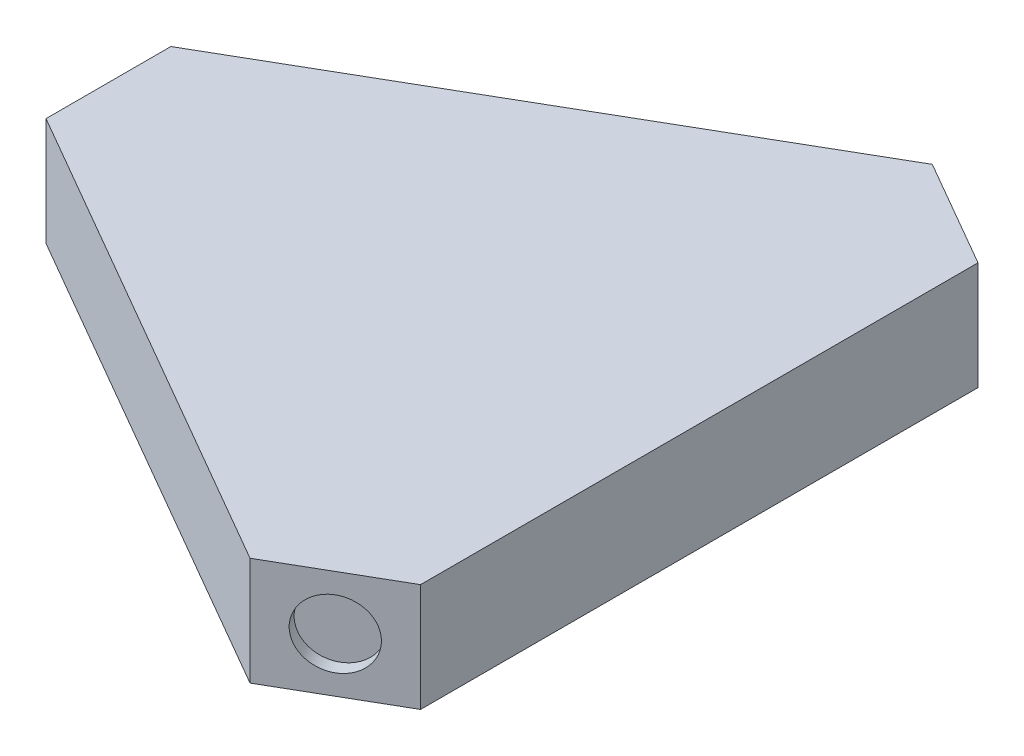
ISO-10303-21;
HEADER;
FILE_DESCRIPTION(('STEP AP214'),'2;1');
FILE_NAME('part.step','',(''),(''),'','','');
FILE_SCHEMA(('AUTOMOTIVE_DESIGN { 1 0 10303 214 1 1 1 1 }'));
ENDSEC;
DATA;
#1=APPLICATION_CONTEXT('core data for automotive mechanical design processes');
#2=APPLICATION_PROTOCOL_DEFINITION('international standard','automotive_design',2000,#1);
#3=PRODUCT_CONTEXT('',#1,'mechanical');
#4=PRODUCT('Part','Part','',(#3));
#5=PRODUCT_RELATED_PRODUCT_CATEGORY('part','',(#4));
#6=PRODUCT_DEFINITION_FORMATION('','',#4);
#7=PRODUCT_DEFINITION_CONTEXT('part definition',#1,'design');
#8=PRODUCT_DEFINITION('design','',#6,#7);
#9=PRODUCT_DEFINITION_SHAPE('','',#8);
#10=(LENGTH_UNIT() NAMED_UNIT(*) SI_UNIT(.MILLI.,.METRE.));
#11=(NAMED_UNIT(*) PLANE_ANGLE_UNIT() SI_UNIT($,.RADIAN.));
#12=(NAMED_UNIT(*) SI_UNIT($,.STERADIAN.) SOLID_ANGLE_UNIT());
#13=UNCERTAINTY_MEASURE_WITH_UNIT(LENGTH_MEASURE(1.E-05),#10,'distance_accuracy_value','');
#14=(GEOMETRIC_REPRESENTATION_CONTEXT(3) GLOBAL_UNCERTAINTY_ASSIGNED_CONTEXT((#13)) GLOBAL_UNIT_ASSIGNED_CONTEXT((#10,
#11,#12)) REPRESENTATION_CONTEXT('',''));
#15=CARTESIAN_POINT('',(0.,0.,0.));
#16=DIRECTION('',(0.,0.,1.));
#17=DIRECTION('',(1.,0.,0.));
#18=AXIS2_PLACEMENT_3D('',#15,#16,#17);
#19=CARTESIAN_POINT('',(22.3463500000001,8.,-47.9426178707508));
#20=DIRECTION('',(-0.5,0.,0.866025403784439));
#21=DIRECTION('',(0.866025403784439,0.,0.5));
#22=AXIS2_PLACEMENT_3D('',#19,#20,#21);
#23=PLANE('',#22);
#24=CARTESIAN_POINT('',(26.34635,4.,-45.6332167939923));
#25=DIRECTION('',(0.5,0.,-0.866025403784439));
#26=DIRECTION('',(-0.866025403784439,0.,-0.5));
#27=AXIS2_PLACEMENT_3D('',#24,#25,#26);
#28=CIRCLE('',#27,2.5);
#29=CARTESIAN_POINT('',(24.1812864905389,4.,-46.8832167939923));
#30=VERTEX_POINT('',#29);
#31=EDGE_CURVE('E172',#30,#30,#28,.T.);
#32=ORIENTED_EDGE('',*,*,#31,.F.);
#33=EDGE_LOOP('',(#32));
#34=FACE_BOUND('',#33,.T.);
#35=DIRECTION('',(-0.866025403784439,0.,-0.5));
#36=VECTOR('',#35,1.);
#37=CARTESIAN_POINT('',(22.3463500000001,0.,-47.9426178707508));
#38=LINE('',#37,#36);
#39=CARTESIAN_POINT('',(30.34635,0.,-43.3238157172339));
#40=VERTEX_POINT('',#39);
#41=CARTESIAN_POINT('',(22.3463500000001,0.,-47.9426178707508));
#42=VERTEX_POINT('',#41);
#43=EDGE_CURVE('E129',#40,#42,#38,.T.);
#44=ORIENTED_EDGE('',*,*,#43,.T.);
#45=DIRECTION('',(0.,-1.,0.));
#46=VECTOR('',#45,1.);
#47=CARTESIAN_POINT('',(22.3463500000001,8.,-47.9426178707508));
#48=LINE('',#47,#46);
#49=CARTESIAN_POINT('',(22.3463500000001,8.,-47.9426178707508));
#50=VERTEX_POINT('',#49);
#51=EDGE_CURVE('E11',#50,#42,#48,.T.);
#52=ORIENTED_EDGE('',*,*,#51,.F.);
#53=DIRECTION('',(-0.866025403784439,0.,-0.5));
#54=VECTOR('',#53,1.);
#55=CARTESIAN_POINT('',(22.3463500000001,8.,-47.9426178707508));
#56=LINE('',#55,#54);
#57=CARTESIAN_POINT('',(30.34635,8.,-43.3238157172339));
#58=VERTEX_POINT('',#57);
#59=EDGE_CURVE('E140',#58,#50,#56,.T.);
#60=ORIENTED_EDGE('',*,*,#59,.F.);
#61=DIRECTION('',(0.,-1.,0.));
#62=VECTOR('',#61,1.);
#63=CARTESIAN_POINT('',(30.34635,8.,-43.3238157172339));
#64=LINE('',#63,#62);
#65=EDGE_CURVE('E125',#58,#40,#64,.T.);
#66=ORIENTED_EDGE('',*,*,#65,.T.);
#67=EDGE_LOOP('',(#44,#52,#60,#66));
#68=FACE_BOUND('',#67,.T.);
#69=ADVANCED_FACE('F45',(#34,#68),#23,.F.);
#70=CARTESIAN_POINT('',(22.3463500000001,8.,-47.9426178707508));
#71=DIRECTION('',(0.5,0.,0.866025403784439));
#72=DIRECTION('',(0.866025403784439,0.,-0.5));
#73=AXIS2_PLACEMENT_3D('',#70,#71,#72);
#74=PLANE('',#73);
#75=DIRECTION('',(-0.866025403784439,0.,0.5));
#76=VECTOR('',#75,1.);
#77=CARTESIAN_POINT('',(22.3463500000001,0.,-47.9426178707508));
#78=LINE('',#77,#76);
#79=CARTESIAN_POINT('',(-13.3696000000001,0.,-27.3220045238875));
#80=VERTEX_POINT('',#79);
#81=EDGE_CURVE('E132',#42,#80,#78,.T.);
#82=ORIENTED_EDGE('',*,*,#81,.T.);
#83=DIRECTION('',(0.,-1.,0.));
#84=VECTOR('',#83,1.);
#85=CARTESIAN_POINT('',(-13.3696000000001,8.,-27.3220045238875));
#86=LINE('',#85,#84);
#87=CARTESIAN_POINT('',(-13.3696000000001,8.,-27.3220045238875));
#88=VERTEX_POINT('',#87);
#89=EDGE_CURVE('E53',#88,#80,#86,.T.);
#90=ORIENTED_EDGE('',*,*,#89,.F.);
#91=DIRECTION('',(-0.866025403784439,0.,0.5));
#92=VECTOR('',#91,1.);
#93=CARTESIAN_POINT('',(22.3463500000001,8.,-47.9426178707508));
#94=LINE('',#93,#92);
#95=EDGE_CURVE('E98',#50,#88,#94,.T.);
#96=ORIENTED_EDGE('',*,*,#95,.F.);
#97=ORIENTED_EDGE('',*,*,#51,.T.);
#98=EDGE_LOOP('',(#82,#90,#96,#97));
#99=FACE_BOUND('',#98,.T.);
#100=ADVANCED_FACE('F165',(#99),#74,.F.);
#101=CARTESIAN_POINT('',(-13.3696000000001,8.,-27.3220045238875));
#102=DIRECTION('',(1.,0.,0.));
#103=DIRECTION('',(0.,0.,-1.));
#104=AXIS2_PLACEMENT_3D('',#101,#102,#103);
#105=PLANE('',#104);
#106=CARTESIAN_POINT('',(-13.3695999999999,4.,-22.7032023703705));
#107=DIRECTION('',(-1.,0.,0.));
#108=DIRECTION('',(0.,0.,1.));
#109=AXIS2_PLACEMENT_3D('',#106,#107,#108);
#110=CIRCLE('',#109,2.5);
#111=CARTESIAN_POINT('',(-13.3695999999999,4.,-20.2032023703705));
#112=VERTEX_POINT('',#111);
#113=EDGE_CURVE('E179',#112,#112,#110,.T.);
#114=ORIENTED_EDGE('',*,*,#113,.F.);
#115=EDGE_LOOP('',(#114));
#116=FACE_BOUND('',#115,.T.);
#117=DIRECTION('',(0.,0.,1.));
#118=VECTOR('',#117,1.);
#119=CARTESIAN_POINT('',(-13.3696000000001,0.,-27.3220045238875));
#120=LINE('',#119,#118);
#121=CARTESIAN_POINT('',(-13.3696000000001,0.,-18.0844002168536));
#122=VERTEX_POINT('',#121);
#123=EDGE_CURVE('E135',#80,#122,#120,.T.);
#124=ORIENTED_EDGE('',*,*,#123,.T.);
#125=DIRECTION('',(0.,-1.,0.));
#126=VECTOR('',#125,1.);
#127=CARTESIAN_POINT('',(-13.3696000000001,8.,-18.0844002168536));
#128=LINE('',#127,#126);
#129=CARTESIAN_POINT('',(-13.3696000000001,8.,-18.0844002168536));
#130=VERTEX_POINT('',#129);
#131=EDGE_CURVE('E120',#130,#122,#128,.T.);
#132=ORIENTED_EDGE('',*,*,#131,.F.);
#133=DIRECTION('',(0.,0.,1.));
#134=VECTOR('',#133,1.);
#135=CARTESIAN_POINT('',(-13.3696000000001,8.,-27.3220045238875));
#136=LINE('',#135,#134);
#137=EDGE_CURVE('E111',#88,#130,#136,.T.);
#138=ORIENTED_EDGE('',*,*,#137,.F.);
#139=ORIENTED_EDGE('',*,*,#89,.T.);
#140=EDGE_LOOP('',(#124,#132,#138,#139));
#141=FACE_BOUND('',#140,.T.);
#142=ADVANCED_FACE('F146',(#116,#141),#105,.F.);
#143=CARTESIAN_POINT('',(-13.3696000000001,8.,-18.0844002168536));
#144=DIRECTION('',(0.5,0.,-0.866025403784439));
#145=DIRECTION('',(-0.866025403784439,0.,-0.5));
#146=AXIS2_PLACEMENT_3D('',#143,#144,#145);
#147=PLANE('',#146);
#148=DIRECTION('',(0.866025403784439,0.,0.5));
#149=VECTOR('',#148,1.);
#150=CARTESIAN_POINT('',(-13.3696000000001,0.,-18.0844002168536));
#151=LINE('',#150,#149);
#152=CARTESIAN_POINT('',(22.3463500000001,0.,2.53621313000971));
#153=VERTEX_POINT('',#152);
#154=EDGE_CURVE('E119',#122,#153,#151,.T.);
#155=ORIENTED_EDGE('',*,*,#154,.T.);
#156=DIRECTION('',(0.,-1.,0.));
#157=VECTOR('',#156,1.);
#158=CARTESIAN_POINT('',(22.3463500000001,8.,2.53621313000971));
#159=LINE('',#158,#157);
#160=CARTESIAN_POINT('',(22.3463500000001,8.,2.53621313000971));
#161=VERTEX_POINT('',#160);
#162=EDGE_CURVE('E116',#161,#153,#159,.T.);
#163=ORIENTED_EDGE('',*,*,#162,.F.);
#164=DIRECTION('',(0.866025403784439,0.,0.5));
#165=VECTOR('',#164,1.);
#166=CARTESIAN_POINT('',(-13.3696000000001,8.,-18.0844002168536));
#167=LINE('',#166,#165);
#168=EDGE_CURVE('E105',#130,#161,#167,.T.);
#169=ORIENTED_EDGE('',*,*,#168,.F.);
#170=ORIENTED_EDGE('',*,*,#131,.T.);
#171=EDGE_LOOP('',(#155,#163,#169,#170));
#172=FACE_BOUND('',#171,.T.);
#173=ADVANCED_FACE('F117',(#172),#147,.F.);
#174=CARTESIAN_POINT('',(30.34635,8.,-2.08258902350725));
#175=DIRECTION('',(-0.5,0.,-0.866025403784439));
#176=DIRECTION('',(-0.866025403784439,0.,0.5));
#177=AXIS2_PLACEMENT_3D('',#174,#175,#176);
#178=PLANE('',#177);
#179=CARTESIAN_POINT('',(26.3463500000003,4.,0.226812053250883));
#180=DIRECTION('',(0.500000000000008,0.,0.866025403784434));
#181=DIRECTION('',(0.866025403784434,0.,-0.500000000000008));
#182=AXIS2_PLACEMENT_3D('',#179,#180,#181);
#183=CIRCLE('',#182,2.5);
#184=CARTESIAN_POINT('',(28.5114135094613,4.,-1.02318794674914));
#185=VERTEX_POINT('',#184);
#186=EDGE_CURVE('E184',#185,#185,#183,.T.);
#187=ORIENTED_EDGE('',*,*,#186,.F.);
#188=EDGE_LOOP('',(#187));
#189=FACE_BOUND('',#188,.T.);
#190=DIRECTION('',(0.866025403784439,0.,-0.5));
#191=VECTOR('',#190,1.);
#192=CARTESIAN_POINT('',(30.34635,0.,-2.08258902350725));
#193=LINE('',#192,#191);
#194=CARTESIAN_POINT('',(30.34635,0.,-2.08258902350725));
#195=VERTEX_POINT('',#194);
#196=EDGE_CURVE('E84',#153,#195,#193,.T.);
#197=ORIENTED_EDGE('',*,*,#196,.T.);
#198=DIRECTION('',(0.,-1.,0.));
#199=VECTOR('',#198,1.);
#200=CARTESIAN_POINT('',(30.34635,8.,-2.08258902350725));
#201=LINE('',#200,#199);
#202=CARTESIAN_POINT('',(30.34635,8.,-2.08258902350725));
#203=VERTEX_POINT('',#202);
#204=EDGE_CURVE('E121',#203,#195,#201,.T.);
#205=ORIENTED_EDGE('',*,*,#204,.F.);
#206=DIRECTION('',(0.866025403784439,0.,-0.5));
#207=VECTOR('',#206,1.);
#208=CARTESIAN_POINT('',(30.34635,8.,-2.08258902350725));
#209=LINE('',#208,#207);
#210=EDGE_CURVE('E109',#161,#203,#209,.T.);
#211=ORIENTED_EDGE('',*,*,#210,.F.);
#212=ORIENTED_EDGE('',*,*,#162,.T.);
#213=EDGE_LOOP('',(#197,#205,#211,#212));
#214=FACE_BOUND('',#213,.T.);
#215=ADVANCED_FACE('F123',(#189,#214),#178,.F.);
#216=CARTESIAN_POINT('',(30.34635,8.,-2.08258902350725));
#217=DIRECTION('',(-1.,0.,0.));
#218=DIRECTION('',(0.,0.,1.));
#219=AXIS2_PLACEMENT_3D('',#216,#217,#218);
#220=PLANE('',#219);
#221=DIRECTION('',(0.,0.,-1.));
#222=VECTOR('',#221,1.);
#223=CARTESIAN_POINT('',(30.34635,0.,-2.08258902350725));
#224=LINE('',#223,#222);
#225=EDGE_CURVE('E90',#195,#40,#224,.T.);
#226=ORIENTED_EDGE('',*,*,#225,.T.);
#227=ORIENTED_EDGE('',*,*,#65,.F.);
#228=DIRECTION('',(0.,0.,-1.));
#229=VECTOR('',#228,1.);
#230=CARTESIAN_POINT('',(30.34635,8.,-2.08258902350725));
#231=LINE('',#230,#229);
#232=EDGE_CURVE('E61',#203,#58,#231,.T.);
#233=ORIENTED_EDGE('',*,*,#232,.F.);
#234=ORIENTED_EDGE('',*,*,#204,.T.);
#235=EDGE_LOOP('',(#226,#227,#233,#234));
#236=FACE_BOUND('',#235,.T.);
#237=ADVANCED_FACE('F153',(#236),#220,.F.);
#238=CARTESIAN_POINT('',(0.,8.,0.));
#239=DIRECTION('',(0.,1.,0.));
#240=DIRECTION('',(0.,0.,1.));
#241=AXIS2_PLACEMENT_3D('',#238,#239,#240);
#242=PLANE('',#241);
#243=ORIENTED_EDGE('',*,*,#59,.T.);
#244=ORIENTED_EDGE('',*,*,#95,.T.);
#245=ORIENTED_EDGE('',*,*,#137,.T.);
#246=ORIENTED_EDGE('',*,*,#168,.T.);
#247=ORIENTED_EDGE('',*,*,#210,.T.);
#248=ORIENTED_EDGE('',*,*,#232,.T.);
#249=EDGE_LOOP('',(#243,#244,#245,#246,#247,#248));
#250=FACE_BOUND('',#249,.T.);
#251=ADVANCED_FACE('F107',(#250),#242,.T.);
#252=CARTESIAN_POINT('',(0.,0.,0.));
#253=DIRECTION('',(0.,1.,0.));
#254=DIRECTION('',(0.,0.,1.));
#255=AXIS2_PLACEMENT_3D('',#252,#253,#254);
#256=PLANE('',#255);
#257=ORIENTED_EDGE('',*,*,#43,.F.);
#258=ORIENTED_EDGE('',*,*,#225,.F.);
#259=ORIENTED_EDGE('',*,*,#196,.F.);
#260=ORIENTED_EDGE('',*,*,#154,.F.);
#261=ORIENTED_EDGE('',*,*,#123,.F.);
#262=ORIENTED_EDGE('',*,*,#81,.F.);
#263=EDGE_LOOP('',(#257,#258,#259,#260,#261,#262));
#264=FACE_BOUND('',#263,.T.);
#265=ADVANCED_FACE('F149',(#264),#256,.F.);
#266=CARTESIAN_POINT('',(25.84635,4.,-44.7671913902079));
#267=DIRECTION('',(0.5,0.,-0.866025403784439));
#268=DIRECTION('',(-0.866025403784439,0.,-0.5));
#269=AXIS2_PLACEMENT_3D('',#266,#267,#268);
#270=CYLINDRICAL_SURFACE('',#269,2.5);
#271=CARTESIAN_POINT('',(25.84635,4.,-44.7671913902079));
#272=DIRECTION('',(0.5,0.,-0.866025403784439));
#273=DIRECTION('',(-0.866025403784439,0.,-0.5));
#274=AXIS2_PLACEMENT_3D('',#271,#272,#273);
#275=CIRCLE('',#274,2.5);
#276=CARTESIAN_POINT('',(23.6812864905389,4.,-46.0171913902079));
#277=VERTEX_POINT('',#276);
#278=EDGE_CURVE('E133',#277,#277,#275,.T.);
#279=ORIENTED_EDGE('',*,*,#278,.F.);
#280=EDGE_LOOP('',(#279));
#281=FACE_BOUND('',#280,.T.);
#282=ORIENTED_EDGE('',*,*,#31,.T.);
#283=EDGE_LOOP('',(#282));
#284=FACE_BOUND('',#283,.T.);
#285=ADVANCED_FACE('F223',(#281,#284),#270,.F.);
#286=CARTESIAN_POINT('',(25.84635,4.,-44.7671913902079));
#287=DIRECTION('',(0.5,0.,-0.866025403784439));
#288=DIRECTION('',(-0.866025403784439,0.,-0.5));
#289=AXIS2_PLACEMENT_3D('',#286,#287,#288);
#290=PLANE('',#289);
#291=ORIENTED_EDGE('',*,*,#278,.T.);
#292=EDGE_LOOP('',(#291));
#293=FACE_BOUND('',#292,.T.);
#294=ADVANCED_FACE('F236',(#293),#290,.T.);
#295=CARTESIAN_POINT('',(25.8463500000002,4.,-0.639213350533551));
#296=DIRECTION('',(0.500000000000008,0.,0.866025403784434));
#297=DIRECTION('',(0.866025403784434,0.,-0.500000000000008));
#298=AXIS2_PLACEMENT_3D('',#295,#296,#297);
#299=CYLINDRICAL_SURFACE('',#298,2.5);
#300=CARTESIAN_POINT('',(25.8463500000002,4.,-0.639213350533551));
#301=DIRECTION('',(0.500000000000008,0.,0.866025403784434));
#302=DIRECTION('',(0.866025403784434,0.,-0.500000000000008));
#303=AXIS2_PLACEMENT_3D('',#300,#301,#302);
#304=CIRCLE('',#303,2.5);
#305=CARTESIAN_POINT('',(28.0114135094613,4.,-1.88921335053357));
#306=VERTEX_POINT('',#305);
#307=EDGE_CURVE('E187',#306,#306,#304,.T.);
#308=CARTESIAN_POINT('',(28.0114135094613,4.,-1.88921335053357));
#309=CARTESIAN_POINT('',(28.0166218427947,4.,-1.88019225257748));
#310=CARTESIAN_POINT('',(28.021830176128,4.,-1.8711711546214));
#311=CARTESIAN_POINT('',(28.0322468427947,4.,-1.85312895870922));
#312=CARTESIAN_POINT('',(28.037455176128,4.,-1.84410786075313));
#313=CARTESIAN_POINT('',(28.0478718427947,4.,-1.82606566484096));
#314=CARTESIAN_POINT('',(28.053080176128,4.,-1.81704456688487));
#315=CARTESIAN_POINT('',(28.0634968427947,4.,-1.79900237097269));
#316=CARTESIAN_POINT('',(28.068705176128,4.,-1.78998127301661));
#317=CARTESIAN_POINT('',(28.0791218427947,4.,-1.77193907710443));
#318=CARTESIAN_POINT('',(28.084330176128,4.,-1.76291797914834));
#319=CARTESIAN_POINT('',(28.0947468427947,4.,-1.74487578323617));
#320=CARTESIAN_POINT('',(28.099955176128,4.,-1.73585468528008));
#321=CARTESIAN_POINT('',(28.1103718427947,4.,-1.7178124893679));
#322=CARTESIAN_POINT('',(28.115580176128,4.,-1.70879139141182));
#323=CARTESIAN_POINT('',(28.1259968427947,4.,-1.69074919549964));
#324=CARTESIAN_POINT('',(28.131205176128,4.,-1.68172809754355));
#325=CARTESIAN_POINT('',(28.1416218427947,4.,-1.66368590163138));
#326=CARTESIAN_POINT('',(28.146830176128,4.,-1.65466480367529));
#327=CARTESIAN_POINT('',(28.1572468427947,4.,-1.63662260776311));
#328=CARTESIAN_POINT('',(28.162455176128,4.,-1.62760150980703));
#329=CARTESIAN_POINT('',(28.1728718427947,4.,-1.60955931389485));
#330=CARTESIAN_POINT('',(28.178080176128,4.,-1.60053821593876));
#331=CARTESIAN_POINT('',(28.1884968427947,4.,-1.58249602002659));
#332=CARTESIAN_POINT('',(28.193705176128,4.,-1.5734749220705));
#333=CARTESIAN_POINT('',(28.2041218427947,4.,-1.55543272615832));
#334=CARTESIAN_POINT('',(28.209330176128,4.,-1.54641162820223));
#335=CARTESIAN_POINT('',(28.2197468427947,4.,-1.52836943229006));
#336=CARTESIAN_POINT('',(28.224955176128,4.,-1.51934833433397));
#337=CARTESIAN_POINT('',(28.2353718427947,4.,-1.5013061384218));
#338=CARTESIAN_POINT('',(28.240580176128,4.,-1.49228504046571));
#339=CARTESIAN_POINT('',(28.2509968427947,4.,-1.47424284455353));
#340=CARTESIAN_POINT('',(28.256205176128,4.,-1.46522174659744));
#341=CARTESIAN_POINT('',(28.2666218427947,4.,-1.44717955068527));
#342=CARTESIAN_POINT('',(28.271830176128,4.,-1.43815845272918));
#343=CARTESIAN_POINT('',(28.2822468427947,4.,-1.420116256817));
#344=CARTESIAN_POINT('',(28.287455176128,4.,-1.41109515886092));
#345=CARTESIAN_POINT('',(28.2978718427947,4.,-1.39305296294874));
#346=CARTESIAN_POINT('',(28.303080176128,4.,-1.38403186499265));
#347=CARTESIAN_POINT('',(28.3134968427947,4.,-1.36598966908048));
#348=CARTESIAN_POINT('',(28.318705176128,4.,-1.35696857112439));
#349=CARTESIAN_POINT('',(28.3291218427947,4.,-1.33892637521221));
#350=CARTESIAN_POINT('',(28.334330176128,4.,-1.32990527725613));
#351=CARTESIAN_POINT('',(28.3447468427947,4.,-1.31186308134395));
#352=CARTESIAN_POINT('',(28.349955176128,4.,-1.30284198338786));
#353=CARTESIAN_POINT('',(28.3603718427947,4.,-1.28479978747569));
#354=CARTESIAN_POINT('',(28.365580176128,4.,-1.2757786895196));
#355=CARTESIAN_POINT('',(28.3759968427947,4.,-1.25773649360742));
#356=CARTESIAN_POINT('',(28.381205176128,4.,-1.24871539565134));
#357=CARTESIAN_POINT('',(28.3916218427947,4.,-1.23067319973916));
#358=CARTESIAN_POINT('',(28.396830176128,4.,-1.22165210178307));
#359=CARTESIAN_POINT('',(28.4072468427947,4.,-1.2036099058709));
#360=CARTESIAN_POINT('',(28.412455176128,4.,-1.19458880791481));
#361=CARTESIAN_POINT('',(28.4228718427947,4.,-1.17654661200263));
#362=CARTESIAN_POINT('',(28.428080176128,4.,-1.16752551404654));
#363=CARTESIAN_POINT('',(28.4384968427947,4.,-1.14948331813437));
#364=CARTESIAN_POINT('',(28.443705176128,4.,-1.14046222017828));
#365=CARTESIAN_POINT('',(28.4541218427947,4.,-1.12242002426611));
#366=CARTESIAN_POINT('',(28.459330176128,4.,-1.11339892631002));
#367=CARTESIAN_POINT('',(28.4697468427947,4.,-1.09535673039784));
#368=CARTESIAN_POINT('',(28.474955176128,4.,-1.08633563244175));
#369=CARTESIAN_POINT('',(28.4853718427947,4.,-1.06829343652958));
#370=CARTESIAN_POINT('',(28.490580176128,4.,-1.05927233857349));
#371=CARTESIAN_POINT('',(28.5009968427947,4.,-1.04123014266131));
#372=CARTESIAN_POINT('',(28.506205176128,4.,-1.03220904470523));
#373=CARTESIAN_POINT('',(28.5114135094613,4.,-1.02318794674914));
#374=B_SPLINE_CURVE_WITH_KNOTS('',3,(#308,#309,#310,#311,#312,#313,#314,#315,#316,#317,#318,
#319,#320,#321,#322,#323,#324,#325,#326,#327,#328,#329,#330,#331,#332,#333,#334,#335,#336,#337,
#338,#339,#340,#341,#342,#343,#344,#345,#346,#347,#348,#349,#350,#351,#352,#353,#354,#355,#356,
#357,#358,#359,#360,#361,#362,#363,#364,#365,#366,#367,#368,#369,#370,#371,#372,#373),
.UNSPECIFIED.,.F.,.F.,(4,2,2,2,2,2,2,2,2,2,2,2,2,2,2,2,2,2,2,2,2,2,2,2,2,2,2,2,2,2,2,2,4),(0.,
0.0312499999999989,0.0624999999999997,0.0937500000000005,0.124999999999999,0.15625,
0.187499999999999,0.21875,0.249999999999999,0.28125,0.3125,0.34375,0.375,0.406249999999999,
0.4375,0.468749999999999,0.5,0.53125,0.562499999999999,0.59375,0.624999999999999,0.65625,
0.687499999999999,0.71875,0.75,0.781249999999999,0.8125,0.843749999999999,0.875,
0.906249999999999,0.9375,0.96875,0.999999999999999),.UNSPECIFIED.);
#375=EDGE_CURVE('BSEAM244',#306,#185,#374,.T.);
#376=ORIENTED_EDGE('',*,*,#307,.F.);
#377=ORIENTED_EDGE('',*,*,#186,.T.);
#378=ORIENTED_EDGE('',*,*,#375,.T.);
#379=ORIENTED_EDGE('',*,*,#375,.F.);
#380=EDGE_LOOP('',(#376,#378,#377,#379));
#381=FACE_BOUND('',#380,.T.);
#382=ADVANCED_FACE('F244',(#381),#299,.F.);
#383=CARTESIAN_POINT('',(25.8463500000002,4.,-0.639213350533551));
#384=DIRECTION('',(0.500000000000008,0.,0.866025403784434));
#385=DIRECTION('',(0.866025403784434,0.,-0.500000000000008));
#386=AXIS2_PLACEMENT_3D('',#383,#384,#385);
#387=PLANE('',#386);
#388=ORIENTED_EDGE('',*,*,#307,.T.);
#389=EDGE_LOOP('',(#388));
#390=FACE_BOUND('',#389,.T.);
#391=ADVANCED_FACE('F264',(#390),#387,.T.);
#392=CARTESIAN_POINT('',(-12.3695999999999,4.,-22.7032023703705));
#393=DIRECTION('',(-1.,0.,0.));
#394=DIRECTION('',(0.,0.,1.));
#395=AXIS2_PLACEMENT_3D('',#392,#393,#394);
#396=CYLINDRICAL_SURFACE('',#395,2.5);
#397=CARTESIAN_POINT('',(-12.3695999999999,4.,-22.7032023703705));
#398=DIRECTION('',(-1.,0.,0.));
#399=DIRECTION('',(0.,0.,1.));
#400=AXIS2_PLACEMENT_3D('',#397,#398,#399);
#401=CIRCLE('',#400,2.5);
#402=CARTESIAN_POINT('',(-12.3695999999999,4.,-20.2032023703705));
#403=VERTEX_POINT('',#402);
#404=EDGE_CURVE('E174',#403,#403,#401,.T.);
#405=ORIENTED_EDGE('',*,*,#404,.F.);
#406=EDGE_LOOP('',(#405));
#407=FACE_BOUND('',#406,.T.);
#408=ORIENTED_EDGE('',*,*,#113,.T.);
#409=EDGE_LOOP('',(#408));
#410=FACE_BOUND('',#409,.T.);
#411=ADVANCED_FACE('F193',(#407,#410),#396,.F.);
#412=CARTESIAN_POINT('',(-12.3695999999999,4.,-22.7032023703705));
#413=DIRECTION('',(-1.,0.,0.));
#414=DIRECTION('',(0.,0.,1.));
#415=AXIS2_PLACEMENT_3D('',#412,#413,#414);
#416=PLANE('',#415);
#417=ORIENTED_EDGE('',*,*,#404,.T.);
#418=EDGE_LOOP('',(#417));
#419=FACE_BOUND('',#418,.T.);
#420=ADVANCED_FACE('F281',(#419),#416,.T.);
#421=CLOSED_SHELL('',(#69,#100,#142,#173,#215,#237,#251,#265,#285,#294,#382,#391,#411,#420));
#422=MANIFOLD_SOLID_BREP('B2',#421);
#423=ADVANCED_BREP_SHAPE_REPRESENTATION('',(#18,#422),#14);
#424=SHAPE_DEFINITION_REPRESENTATION(#9,#423);
ENDSEC;
END-ISO-10303-21;
